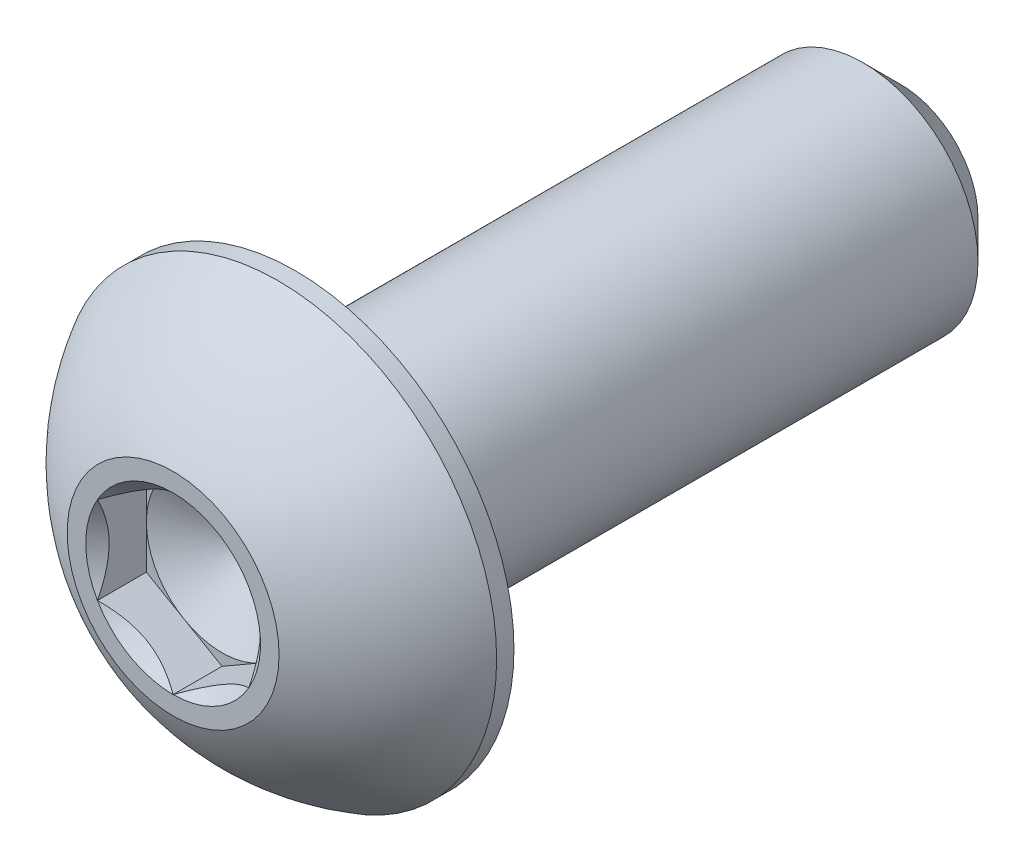
ISO-10303-21;
HEADER;
FILE_DESCRIPTION(('STEP AP214'),'2;1');
FILE_NAME('part.step','',(''),(''),'','','');
FILE_SCHEMA(('AUTOMOTIVE_DESIGN { 1 0 10303 214 1 1 1 1 }'));
ENDSEC;
DATA;
#1=APPLICATION_CONTEXT('core data for automotive mechanical design processes');
#2=APPLICATION_PROTOCOL_DEFINITION('international standard','automotive_design',2000,#1);
#3=PRODUCT_CONTEXT('',#1,'mechanical');
#4=PRODUCT('Part','Part','',(#3));
#5=PRODUCT_RELATED_PRODUCT_CATEGORY('part','',(#4));
#6=PRODUCT_DEFINITION_FORMATION('','',#4);
#7=PRODUCT_DEFINITION_CONTEXT('part definition',#1,'design');
#8=PRODUCT_DEFINITION('design','',#6,#7);
#9=PRODUCT_DEFINITION_SHAPE('','',#8);
#10=(LENGTH_UNIT() NAMED_UNIT(*) SI_UNIT(.MILLI.,.METRE.));
#11=(NAMED_UNIT(*) PLANE_ANGLE_UNIT() SI_UNIT($,.RADIAN.));
#12=(NAMED_UNIT(*) SI_UNIT($,.STERADIAN.) SOLID_ANGLE_UNIT());
#13=UNCERTAINTY_MEASURE_WITH_UNIT(LENGTH_MEASURE(1.E-05),#10,'distance_accuracy_value','');
#14=(GEOMETRIC_REPRESENTATION_CONTEXT(3) GLOBAL_UNCERTAINTY_ASSIGNED_CONTEXT((#13)) GLOBAL_UNIT_ASSIGNED_CONTEXT((#10,
#11,#12)) REPRESENTATION_CONTEXT('',''));
#15=CARTESIAN_POINT('',(0.,0.,0.));
#16=DIRECTION('',(0.,0.,1.));
#17=DIRECTION('',(1.,0.,0.));
#18=AXIS2_PLACEMENT_3D('',#15,#16,#17);
#19=CARTESIAN_POINT('',(0.,1.5875,7.6327));
#20=DIRECTION('',(0.,0.,-1.));
#21=DIRECTION('',(-1.,0.,0.));
#22=AXIS2_PLACEMENT_3D('',#19,#20,#21);
#23=PLANE('',#22);
#24=CARTESIAN_POINT('',(0.,0.,7.6327));
#25=DIRECTION('',(0.,0.,1.));
#26=DIRECTION('',(1.,0.,0.));
#27=AXIS2_PLACEMENT_3D('',#24,#25,#26);
#28=CIRCLE('',#27,2.2225);
#29=CARTESIAN_POINT('',(2.2225,0.,7.6327));
#30=VERTEX_POINT('',#29);
#31=EDGE_CURVE('E167',#30,#30,#28,.T.);
#32=ORIENTED_EDGE('',*,*,#31,.T.);
#33=EDGE_LOOP('',(#32));
#34=FACE_BOUND('',#33,.T.);
#35=CARTESIAN_POINT('',(0.,0.,7.6327));
#36=DIRECTION('',(0.,0.,1.));
#37=DIRECTION('',(1.,0.,0.));
#38=AXIS2_PLACEMENT_3D('',#35,#36,#37);
#39=CIRCLE('',#38,1.83308710467706);
#40=CARTESIAN_POINT('',(0.,1.83308710467706,7.6327));
#41=VERTEX_POINT('',#40);
#42=CARTESIAN_POINT('',(-1.5875,0.916543552338531,7.6327));
#43=VERTEX_POINT('',#42);
#44=EDGE_CURVE('E121',#41,#43,#39,.T.);
#45=ORIENTED_EDGE('',*,*,#44,.F.);
#46=CARTESIAN_POINT('',(0.,0.,7.6327));
#47=DIRECTION('',(0.,0.,1.));
#48=DIRECTION('',(1.,0.,0.));
#49=AXIS2_PLACEMENT_3D('',#46,#47,#48);
#50=CIRCLE('',#49,1.83308710467706);
#51=CARTESIAN_POINT('',(1.5875,0.916543552338531,7.6327));
#52=VERTEX_POINT('',#51);
#53=EDGE_CURVE('E106',#52,#41,#50,.T.);
#54=ORIENTED_EDGE('',*,*,#53,.F.);
#55=CARTESIAN_POINT('',(0.,0.,7.6327));
#56=DIRECTION('',(0.,0.,1.));
#57=DIRECTION('',(1.,0.,0.));
#58=AXIS2_PLACEMENT_3D('',#55,#56,#57);
#59=CIRCLE('',#58,1.83308710467706);
#60=CARTESIAN_POINT('',(1.5875,-0.916543552338531,7.6327));
#61=VERTEX_POINT('',#60);
#62=EDGE_CURVE('E117',#61,#52,#59,.T.);
#63=ORIENTED_EDGE('',*,*,#62,.F.);
#64=CARTESIAN_POINT('',(0.,0.,7.6327));
#65=DIRECTION('',(0.,0.,1.));
#66=DIRECTION('',(1.,0.,0.));
#67=AXIS2_PLACEMENT_3D('',#64,#65,#66);
#68=CIRCLE('',#67,1.83308710467706);
#69=CARTESIAN_POINT('',(0.,-1.83308710467706,7.6327));
#70=VERTEX_POINT('',#69);
#71=EDGE_CURVE('E138',#70,#61,#68,.T.);
#72=ORIENTED_EDGE('',*,*,#71,.F.);
#73=CARTESIAN_POINT('',(0.,0.,7.6327));
#74=DIRECTION('',(0.,0.,1.));
#75=DIRECTION('',(1.,0.,0.));
#76=AXIS2_PLACEMENT_3D('',#73,#74,#75);
#77=CIRCLE('',#76,1.83308710467706);
#78=CARTESIAN_POINT('',(-1.5875,-0.916543552338531,7.6327));
#79=VERTEX_POINT('',#78);
#80=EDGE_CURVE('E438',#79,#70,#77,.T.);
#81=ORIENTED_EDGE('',*,*,#80,.F.);
#82=CARTESIAN_POINT('',(0.,0.,7.6327));
#83=DIRECTION('',(0.,0.,1.));
#84=DIRECTION('',(1.,0.,0.));
#85=AXIS2_PLACEMENT_3D('',#82,#83,#84);
#86=CIRCLE('',#85,1.83308710467706);
#87=EDGE_CURVE('E447',#43,#79,#86,.T.);
#88=ORIENTED_EDGE('',*,*,#87,.F.);
#89=EDGE_LOOP('',(#45,#54,#63,#72,#81,#88));
#90=FACE_BOUND('',#89,.T.);
#91=ADVANCED_FACE('F33',(#34,#90),#23,.F.);
#92=CARTESIAN_POINT('',(0.,0.,-7.6327));
#93=DIRECTION('',(0.,0.,1.));
#94=DIRECTION('',(1.,0.,0.));
#95=AXIS2_PLACEMENT_3D('',#92,#93,#94);
#96=CONICAL_SURFACE('',#95,1.61925,0.785398163397447);
#97=CARTESIAN_POINT('',(0.,0.,-6.83895));
#98=DIRECTION('',(0.,0.,1.));
#99=DIRECTION('',(1.,0.,0.));
#100=AXIS2_PLACEMENT_3D('',#97,#98,#99);
#101=CIRCLE('',#100,2.413);
#102=CARTESIAN_POINT('',(2.413,0.,-6.83895));
#103=VERTEX_POINT('',#102);
#104=EDGE_CURVE('E11',#103,#103,#101,.T.);
#105=ORIENTED_EDGE('',*,*,#104,.F.);
#106=EDGE_LOOP('',(#105));
#107=FACE_BOUND('',#106,.T.);
#108=CARTESIAN_POINT('',(0.,0.,-7.6327));
#109=DIRECTION('',(0.,0.,1.));
#110=DIRECTION('',(1.,0.,0.));
#111=AXIS2_PLACEMENT_3D('',#108,#109,#110);
#112=CIRCLE('',#111,1.61925);
#113=CARTESIAN_POINT('',(1.61925,0.,-7.6327));
#114=VERTEX_POINT('',#113);
#115=EDGE_CURVE('E160',#114,#114,#112,.T.);
#116=ORIENTED_EDGE('',*,*,#115,.T.);
#117=EDGE_LOOP('',(#116));
#118=FACE_BOUND('',#117,.T.);
#119=ADVANCED_FACE('F35',(#107,#118),#96,.T.);
#120=CARTESIAN_POINT('',(0.,0.,7.6327));
#121=DIRECTION('',(0.,0.,1.));
#122=DIRECTION('',(1.,0.,0.));
#123=AXIS2_PLACEMENT_3D('',#120,#121,#122);
#124=CYLINDRICAL_SURFACE('',#123,2.413);
#125=CARTESIAN_POINT('',(0.,0.,5.0673));
#126=DIRECTION('',(0.,0.,1.));
#127=DIRECTION('',(1.,0.,0.));
#128=AXIS2_PLACEMENT_3D('',#125,#126,#127);
#129=CIRCLE('',#128,2.413);
#130=CARTESIAN_POINT('',(2.413,0.,5.0673));
#131=VERTEX_POINT('',#130);
#132=EDGE_CURVE('E41',#131,#131,#129,.T.);
#133=ORIENTED_EDGE('',*,*,#132,.F.);
#134=EDGE_LOOP('',(#133));
#135=FACE_BOUND('',#134,.T.);
#136=ORIENTED_EDGE('',*,*,#104,.T.);
#137=EDGE_LOOP('',(#136));
#138=FACE_BOUND('',#137,.T.);
#139=ADVANCED_FACE('F181',(#135,#138),#124,.T.);
#140=CARTESIAN_POINT('',(0.,4.5847,5.0673));
#141=DIRECTION('',(0.,0.,1.));
#142=DIRECTION('',(1.,0.,0.));
#143=AXIS2_PLACEMENT_3D('',#140,#141,#142);
#144=PLANE('',#143);
#145=CARTESIAN_POINT('',(0.,0.,5.0673));
#146=DIRECTION('',(0.,0.,1.));
#147=DIRECTION('',(1.,0.,0.));
#148=AXIS2_PLACEMENT_3D('',#145,#146,#147);
#149=CIRCLE('',#148,4.5847);
#150=CARTESIAN_POINT('',(4.5847,0.,5.0673));
#151=VERTEX_POINT('',#150);
#152=EDGE_CURVE('E174',#151,#151,#149,.T.);
#153=ORIENTED_EDGE('',*,*,#152,.F.);
#154=EDGE_LOOP('',(#153));
#155=FACE_BOUND('',#154,.T.);
#156=ORIENTED_EDGE('',*,*,#132,.T.);
#157=EDGE_LOOP('',(#156));
#158=FACE_BOUND('',#157,.T.);
#159=ADVANCED_FACE('F179',(#155,#158),#144,.F.);
#160=CARTESIAN_POINT('',(0.,0.,7.6327));
#161=DIRECTION('',(0.,0.,1.));
#162=DIRECTION('',(1.,0.,0.));
#163=AXIS2_PLACEMENT_3D('',#160,#161,#162);
#164=CYLINDRICAL_SURFACE('',#163,4.5847);
#165=CARTESIAN_POINT('',(0.,0.,5.43015714285714));
#166=DIRECTION('',(0.,0.,1.));
#167=DIRECTION('',(1.,0.,0.));
#168=AXIS2_PLACEMENT_3D('',#165,#166,#167);
#169=CIRCLE('',#168,4.5847);
#170=CARTESIAN_POINT('',(4.5847,0.,5.43015714285714));
#171=VERTEX_POINT('',#170);
#172=EDGE_CURVE('E171',#171,#171,#169,.T.);
#173=ORIENTED_EDGE('',*,*,#172,.F.);
#174=EDGE_LOOP('',(#173));
#175=FACE_BOUND('',#174,.T.);
#176=ORIENTED_EDGE('',*,*,#152,.T.);
#177=EDGE_LOOP('',(#176));
#178=FACE_BOUND('',#177,.T.);
#179=ADVANCED_FACE('F200',(#175,#178),#164,.T.);
#180=CARTESIAN_POINT('',(0.,0.,2.88110962579431));
#181=DIRECTION('',(0.,0.,1.));
#182=DIRECTION('',(0.,1.,0.));
#183=AXIS2_PLACEMENT_3D('',#180,#181,#182);
#184=SPHERICAL_SURFACE('',#183,5.24567606074224);
#185=ORIENTED_EDGE('',*,*,#31,.F.);
#186=EDGE_LOOP('',(#185));
#187=FACE_BOUND('',#186,.T.);
#188=ORIENTED_EDGE('',*,*,#172,.T.);
#189=EDGE_LOOP('',(#188));
#190=FACE_BOUND('',#189,.T.);
#191=ADVANCED_FACE('F192',(#187,#190),#184,.T.);
#192=CARTESIAN_POINT('',(0.,1.61925,-7.6327));
#193=DIRECTION('',(0.,0.,1.));
#194=DIRECTION('',(1.,0.,0.));
#195=AXIS2_PLACEMENT_3D('',#192,#193,#194);
#196=PLANE('',#195);
#197=ORIENTED_EDGE('',*,*,#115,.F.);
#198=EDGE_LOOP('',(#197));
#199=FACE_BOUND('',#198,.T.);
#200=ADVANCED_FACE('F190',(#199),#196,.F.);
#201=CARTESIAN_POINT('',(1.5875,0.916543552338532,7.6327));
#202=DIRECTION('',(-0.499999999999999,-0.866025403784439,0.));
#203=DIRECTION('',(0.866025403784439,-0.499999999999999,0.));
#204=AXIS2_PLACEMENT_3D('',#201,#202,#203);
#205=PLANE('',#204);
#206=CARTESIAN_POINT('',(1.5877,0.916428082284694,7.63281548096371));
#207=CARTESIAN_POINT('',(1.53312479190086,0.94793709337181,7.6013308083706));
#208=CARTESIAN_POINT('',(1.47763696320971,0.979973006203396,7.57169504601353));
#209=CARTESIAN_POINT('',(1.36449087915364,1.04529792829092,7.51743226002082));
#210=CARTESIAN_POINT('',(1.30682185887062,1.07859315267522,7.49283543513318));
#211=CARTESIAN_POINT('',(1.1905349781269,1.14573141457583,7.45070036427258));
#212=CARTESIAN_POINT('',(1.13194674474407,1.17955734689075,7.43305619272982));
#213=CARTESIAN_POINT('',(1.01348022674557,1.24795402294715,7.40587147008497));
#214=CARTESIAN_POINT('',(0.953605562983894,1.28252267618759,7.39631062069508));
#215=CARTESIAN_POINT('',(0.850418771876556,1.34209759781022,7.38768441310401));
#216=CARTESIAN_POINT('',(0.807240015952286,1.36702686416637,7.38640719280958));
#217=CARTESIAN_POINT('',(0.720953038535397,1.41684467380557,7.3885570558147));
#218=CARTESIAN_POINT('',(0.67784484707861,1.44173319974743,7.39198578854934));
#219=CARTESIAN_POINT('',(0.592046335002029,1.49126899379091,7.40335099443334));
#220=CARTESIAN_POINT('',(0.549356408925404,1.51591603410293,7.41129137180164));
#221=CARTESIAN_POINT('',(0.464693063478357,1.56479643938728,7.4312484144511));
#222=CARTESIAN_POINT('',(0.422719959755073,1.58902962212064,7.44326682920869));
#223=CARTESIAN_POINT('',(0.315211458113564,1.65109968448354,7.47894689724725));
#224=CARTESIAN_POINT('',(0.250342771708898,1.68855163804125,7.50529857230314));
#225=CARTESIAN_POINT('',(0.154961599380923,1.74361998356043,7.5497835368517));
#226=CARTESIAN_POINT('',(0.123530699536156,1.76176662204668,7.56541285780113));
#227=CARTESIAN_POINT('',(0.0612469855696361,1.79772614107138,7.5980984878611));
#228=CARTESIAN_POINT('',(0.0303939039605758,1.8155391760437,7.61515411565697));
#229=CARTESIAN_POINT('',(-0.00020000000000091,1.8332025747309,7.63281548096371));
#230=B_SPLINE_CURVE_WITH_KNOTS('',3,(#206,#207,#208,#209,#210,#211,#212,#213,#214,#215,#216,
#217,#218,#219,#220,#221,#222,#223,#224,#225,#226,#227,#228,#229),.UNSPECIFIED.,.F.,.F.,(4,2,2,
2,2,2,2,2,2,2,2,4),(0.,0.211482650810817,0.424197870807277,0.633533884524816,0.84234265326335,
0.991755553727143,1.14122083674205,1.29081565918877,1.44047473906438,1.6781878086972,
1.79671410024894,1.91518409436631),.UNSPECIFIED.);
#231=EDGE_CURVE('E103',#52,#41,#230,.T.);
#232=ORIENTED_EDGE('',*,*,#231,.T.);
#233=DIRECTION('',(0.,0.,-1.));
#234=VECTOR('',#233,1.);
#235=CARTESIAN_POINT('',(0.,1.83308710467706,7.6327));
#236=LINE('',#235,#234);
#237=CARTESIAN_POINT('',(0.,1.83308710467706,6.60654));
#238=VERTEX_POINT('',#237);
#239=EDGE_CURVE('E158',#41,#238,#236,.T.);
#240=ORIENTED_EDGE('',*,*,#239,.T.);
#241=DIRECTION('',(-0.866025403784439,0.499999999999999,0.));
#242=VECTOR('',#241,1.);
#243=CARTESIAN_POINT('',(1.5875,0.916543552338532,6.60654));
#244=LINE('',#243,#242);
#245=CARTESIAN_POINT('',(0.793749999999999,1.3748153285078,6.60654));
#246=VERTEX_POINT('',#245);
#247=EDGE_CURVE('E474',#246,#238,#244,.T.);
#248=ORIENTED_EDGE('',*,*,#247,.F.);
#249=CARTESIAN_POINT('',(1.5875,0.916543552338532,6.60654));
#250=VERTEX_POINT('',#249);
#251=EDGE_CURVE('E48',#250,#246,#244,.T.);
#252=ORIENTED_EDGE('',*,*,#251,.F.);
#253=DIRECTION('',(0.,0.,-1.));
#254=VECTOR('',#253,1.);
#255=CARTESIAN_POINT('',(1.5875,0.916543552338532,7.6327));
#256=LINE('',#255,#254);
#257=EDGE_CURVE('E134',#52,#250,#256,.T.);
#258=ORIENTED_EDGE('',*,*,#257,.F.);
#259=EDGE_LOOP('',(#232,#240,#248,#252,#258));
#260=FACE_BOUND('',#259,.T.);
#261=ADVANCED_FACE('F140',(#260),#205,.T.);
#262=CARTESIAN_POINT('',(0.,1.83308710467706,7.6327));
#263=DIRECTION('',(0.500000000000001,-0.866025403784438,0.));
#264=DIRECTION('',(0.866025403784438,0.500000000000001,0.));
#265=AXIS2_PLACEMENT_3D('',#262,#263,#264);
#266=PLANE('',#265);
#267=CARTESIAN_POINT('',(0.000199999999998876,1.8332025747309,7.63281548096371));
#268=CARTESIAN_POINT('',(-0.0543752080991377,1.80169356364378,7.6013308083706));
#269=CARTESIAN_POINT('',(-0.109863036790291,1.7696576508122,7.57169504601353));
#270=CARTESIAN_POINT('',(-0.22300912084636,1.70433272872467,7.51743226002082));
#271=CARTESIAN_POINT('',(-0.280678141129382,1.67103750434037,7.49283543513318));
#272=CARTESIAN_POINT('',(-0.396965021873104,1.60389924243976,7.45070036427258));
#273=CARTESIAN_POINT('',(-0.455553255255932,1.57007331012484,7.43305619272982));
#274=CARTESIAN_POINT('',(-0.574019773254432,1.50167663406845,7.40587147008497));
#275=CARTESIAN_POINT('',(-0.633894437016106,1.46710798082801,7.39631062069508));
#276=CARTESIAN_POINT('',(-0.737081228123443,1.40753305920537,7.38768441310401));
#277=CARTESIAN_POINT('',(-0.780259984047713,1.38260379284922,7.38640719280957));
#278=CARTESIAN_POINT('',(-0.866546961464602,1.33278598321002,7.3885570558147));
#279=CARTESIAN_POINT('',(-0.909655152921389,1.30789745726817,7.39198578854934));
#280=CARTESIAN_POINT('',(-0.99545366499797,1.25836166322468,7.40335099443334));
#281=CARTESIAN_POINT('',(-1.03814359107459,1.23371462291266,7.41129137180164));
#282=CARTESIAN_POINT('',(-1.12280693652164,1.18483421762831,7.4312484144511));
#283=CARTESIAN_POINT('',(-1.16478004024493,1.16060103489495,7.44326682920869));
#284=CARTESIAN_POINT('',(-1.27228854188643,1.09853097253205,7.47894689724724));
#285=CARTESIAN_POINT('',(-1.3371572282911,1.06107901897434,7.50529857230314));
#286=CARTESIAN_POINT('',(-1.43253840061908,1.00601067345516,7.5497835368517));
#287=CARTESIAN_POINT('',(-1.46396930046384,0.987864034968913,7.56541285780113));
#288=CARTESIAN_POINT('',(-1.52625301443036,0.951904515944213,7.5980984878611));
#289=CARTESIAN_POINT('',(-1.55710609603942,0.934091480971893,7.61515411565697));
#290=CARTESIAN_POINT('',(-1.5877,0.916428082284692,7.63281548096371));
#291=B_SPLINE_CURVE_WITH_KNOTS('',3,(#267,#268,#269,#270,#271,#272,#273,#274,#275,#276,#277,
#278,#279,#280,#281,#282,#283,#284,#285,#286,#287,#288,#289,#290),.UNSPECIFIED.,.F.,.F.,(4,2,2,
2,2,2,2,2,2,2,2,4),(0.,0.211482650810816,0.424197870807276,0.633533884524816,0.842342653263348,
0.991755553727141,1.14122083674204,1.29081565918877,1.44047473906438,1.6781878086972,
1.79671410024894,1.91518409436631),.UNSPECIFIED.);
#292=EDGE_CURVE('E462',#41,#43,#291,.T.);
#293=ORIENTED_EDGE('',*,*,#292,.T.);
#294=DIRECTION('',(0.,0.,-1.));
#295=VECTOR('',#294,1.);
#296=CARTESIAN_POINT('',(-1.5875,0.91654355233853,7.6327));
#297=LINE('',#296,#295);
#298=CARTESIAN_POINT('',(-1.5875,0.91654355233853,6.60654));
#299=VERTEX_POINT('',#298);
#300=EDGE_CURVE('E155',#43,#299,#297,.T.);
#301=ORIENTED_EDGE('',*,*,#300,.T.);
#302=DIRECTION('',(-0.866025403784438,-0.500000000000001,0.));
#303=VECTOR('',#302,1.);
#304=CARTESIAN_POINT('',(0.,1.83308710467706,6.60654));
#305=LINE('',#304,#303);
#306=CARTESIAN_POINT('',(-0.793750000000001,1.3748153285078,6.60654));
#307=VERTEX_POINT('',#306);
#308=EDGE_CURVE('E476',#307,#299,#305,.T.);
#309=ORIENTED_EDGE('',*,*,#308,.F.);
#310=EDGE_CURVE('E477',#238,#307,#305,.T.);
#311=ORIENTED_EDGE('',*,*,#310,.F.);
#312=ORIENTED_EDGE('',*,*,#239,.F.);
#313=EDGE_LOOP('',(#293,#301,#309,#311,#312));
#314=FACE_BOUND('',#313,.T.);
#315=ADVANCED_FACE('F198',(#314),#266,.T.);
#316=CARTESIAN_POINT('',(-1.5875,0.91654355233853,7.6327));
#317=DIRECTION('',(1.,0.,0.));
#318=DIRECTION('',(0.,0.,-1.));
#319=AXIS2_PLACEMENT_3D('',#316,#317,#318);
#320=PLANE('',#319);
#321=CARTESIAN_POINT('',(-1.5875,-1.8064504268921,8.20448698658398));
#322=CARTESIAN_POINT('',(-1.5875,-1.76236619947005,8.17137765189215));
#323=CARTESIAN_POINT('',(-1.5875,-1.71803401722459,8.13859936728741));
#324=CARTESIAN_POINT('',(-1.5875,-1.62877387436181,8.07384092729782));
#325=CARTESIAN_POINT('',(-1.5875,-1.58384576476286,8.04186097748321));
#326=CARTESIAN_POINT('',(-1.5875,-1.44736053267712,7.94686696154791));
#327=CARTESIAN_POINT('',(-1.5875,-1.3547728804759,7.88530882424476));
#328=CARTESIAN_POINT('',(-1.5875,-1.16075761948671,7.76465751972008));
#329=CARTESIAN_POINT('',(-1.5875,-1.05912459725148,7.70589084409804));
#330=CARTESIAN_POINT('',(-1.5875,-0.850810108093356,7.59853067812025));
#331=CARTESIAN_POINT('',(-1.5875,-0.744147188151383,7.5499029254242));
#332=CARTESIAN_POINT('',(-1.5875,-0.583837187923045,7.49041807950615));
#333=CARTESIAN_POINT('',(-1.5875,-0.532518160842358,7.47331011476258));
#334=CARTESIAN_POINT('',(-1.5875,-0.428659985513866,7.44321705307571));
#335=CARTESIAN_POINT('',(-1.5875,-0.37612075167657,7.43023224628787));
#336=CARTESIAN_POINT('',(-1.5875,-0.271003698108568,7.40927039746268));
#337=CARTESIAN_POINT('',(-1.5875,-0.218442994151922,7.40120885122062));
#338=CARTESIAN_POINT('',(-1.5875,-0.112783135871372,7.39024746810392));
#339=CARTESIAN_POINT('',(-1.5875,-0.0596840710482699,7.38734678695656));
#340=CARTESIAN_POINT('',(-1.5875,0.0447055832560295,7.38691381931861));
#341=CARTESIAN_POINT('',(-1.5875,0.0959954901561851,7.38920012793679));
#342=CARTESIAN_POINT('',(-1.5875,0.19812518570528,7.39861970580147));
#343=CARTESIAN_POINT('',(-1.5875,0.248964929488492,7.40575345278263));
#344=CARTESIAN_POINT('',(-1.5875,0.350686556652123,7.42460310969938));
#345=CARTESIAN_POINT('',(-1.5875,0.401553911407877,7.43639626149498));
#346=CARTESIAN_POINT('',(-1.5875,0.50217981053946,7.46394443755636));
#347=CARTESIAN_POINT('',(-1.5875,0.551938454553038,7.47969910423224));
#348=CARTESIAN_POINT('',(-1.5875,0.709597941546692,7.53551737605638));
#349=CARTESIAN_POINT('',(-1.5875,0.815228306930166,7.58197915633839));
#350=CARTESIAN_POINT('',(-1.5875,1.02151735170486,7.68525145508529));
#351=CARTESIAN_POINT('',(-1.5875,1.12215634479547,7.74209935808162));
#352=CARTESIAN_POINT('',(-1.5875,1.31447644029508,7.85934912470739));
#353=CARTESIAN_POINT('',(-1.5875,1.40635401847359,7.91943268451341));
#354=CARTESIAN_POINT('',(-1.5875,1.54171769329396,8.01230190804474));
#355=CARTESIAN_POINT('',(-1.5875,1.58625419266992,8.04358312786968));
#356=CARTESIAN_POINT('',(-1.5875,1.67471932537719,8.10696920360769));
#357=CARTESIAN_POINT('',(-1.5875,1.71864812234279,8.13907383088692));
#358=CARTESIAN_POINT('',(-1.5875,1.76232404534813,8.17151978447609));
#359=B_SPLINE_CURVE_WITH_KNOTS('',3,(#321,#322,#323,#324,#325,#326,#327,#328,#329,#330,#331,
#332,#333,#334,#335,#336,#337,#338,#339,#340,#341,#342,#343,#344,#345,#346,#347,#348,#349,#350,
#351,#352,#353,#354,#355,#356,#357,#358),.UNSPECIFIED.,.F.,.F.,(4,2,2,2,2,2,2,2,2,2,2,2,2,2,2,2,
2,2,4),(0.,0.165394720611771,0.330831599805601,0.664230904656282,1.01613642769877,
1.36683276443451,1.5289815746679,1.69114179313303,1.85043410106595,2.00970034776346,
2.16348276168557,2.31728033368487,2.47374234648083,2.63019024115108,2.97536284656899,
3.32180328575216,3.65097853196649,3.8142455159316,3.97746764647571),.UNSPECIFIED.);
#360=EDGE_CURVE('E455',#43,#79,#359,.F.);
#361=ORIENTED_EDGE('',*,*,#360,.T.);
#362=DIRECTION('',(0.,0.,-1.));
#363=VECTOR('',#362,1.);
#364=CARTESIAN_POINT('',(-1.5875,-0.916543552338532,7.6327));
#365=LINE('',#364,#363);
#366=CARTESIAN_POINT('',(-1.5875,-0.916543552338532,6.60654));
#367=VERTEX_POINT('',#366);
#368=EDGE_CURVE('E152',#79,#367,#365,.T.);
#369=ORIENTED_EDGE('',*,*,#368,.T.);
#370=DIRECTION('',(0.,-1.,0.));
#371=VECTOR('',#370,1.);
#372=CARTESIAN_POINT('',(-1.5875,0.91654355233853,6.60654));
#373=LINE('',#372,#371);
#374=CARTESIAN_POINT('',(-1.5875,0.,6.60654));
#375=VERTEX_POINT('',#374);
#376=EDGE_CURVE('E480',#375,#367,#373,.T.);
#377=ORIENTED_EDGE('',*,*,#376,.F.);
#378=EDGE_CURVE('E481',#299,#375,#373,.T.);
#379=ORIENTED_EDGE('',*,*,#378,.F.);
#380=ORIENTED_EDGE('',*,*,#300,.F.);
#381=EDGE_LOOP('',(#361,#369,#377,#379,#380));
#382=FACE_BOUND('',#381,.T.);
#383=ADVANCED_FACE('F319',(#382),#320,.T.);
#384=CARTESIAN_POINT('',(-1.5875,-0.916543552338532,7.6327));
#385=DIRECTION('',(0.5,0.866025403784439,0.));
#386=DIRECTION('',(-0.866025403784439,0.5,0.));
#387=AXIS2_PLACEMENT_3D('',#384,#385,#386);
#388=PLANE('',#387);
#389=CARTESIAN_POINT('',(-1.5877,-0.916428082284694,7.63281548096371));
#390=CARTESIAN_POINT('',(-1.53312479190086,-0.94793709337181,7.6013308083706));
#391=CARTESIAN_POINT('',(-1.47763696320971,-0.979973006203395,7.57169504601353));
#392=CARTESIAN_POINT('',(-1.36449087915364,-1.04529792829092,7.51743226002082));
#393=CARTESIAN_POINT('',(-1.30682185887062,-1.07859315267522,7.49283543513318));
#394=CARTESIAN_POINT('',(-1.1905349781269,-1.14573141457583,7.45070036427258));
#395=CARTESIAN_POINT('',(-1.13194674474407,-1.17955734689075,7.43305619272982));
#396=CARTESIAN_POINT('',(-1.01348022674557,-1.24795402294714,7.40587147008497));
#397=CARTESIAN_POINT('',(-0.953605562983895,-1.28252267618759,7.39631062069508));
#398=CARTESIAN_POINT('',(-0.850418771876557,-1.34209759781022,7.38768441310401));
#399=CARTESIAN_POINT('',(-0.807240015952287,-1.36702686416637,7.38640719280957));
#400=CARTESIAN_POINT('',(-0.720953038535398,-1.41684467380557,7.3885570558147));
#401=CARTESIAN_POINT('',(-0.677844847078611,-1.44173319974742,7.39198578854934));
#402=CARTESIAN_POINT('',(-0.59204633500203,-1.49126899379091,7.40335099443334));
#403=CARTESIAN_POINT('',(-0.549356408925406,-1.51591603410293,7.41129137180164));
#404=CARTESIAN_POINT('',(-0.464693063478358,-1.56479643938728,7.4312484144511));
#405=CARTESIAN_POINT('',(-0.422719959755074,-1.58902962212064,7.44326682920869));
#406=CARTESIAN_POINT('',(-0.315211458113566,-1.65109968448354,7.47894689724725));
#407=CARTESIAN_POINT('',(-0.2503427717089,-1.68855163804125,7.50529857230314));
#408=CARTESIAN_POINT('',(-0.154961599380923,-1.74361998356043,7.5497835368517));
#409=CARTESIAN_POINT('',(-0.123530699536156,-1.76176662204668,7.56541285780113));
#410=CARTESIAN_POINT('',(-0.061246985569636,-1.79772614107138,7.5980984878611));
#411=CARTESIAN_POINT('',(-0.0303939039605754,-1.8155391760437,7.61515411565697));
#412=CARTESIAN_POINT('',(0.000200000000001136,-1.8332025747309,7.63281548096371));
#413=B_SPLINE_CURVE_WITH_KNOTS('',3,(#389,#390,#391,#392,#393,#394,#395,#396,#397,#398,#399,
#400,#401,#402,#403,#404,#405,#406,#407,#408,#409,#410,#411,#412),.UNSPECIFIED.,.F.,.F.,(4,2,2,
2,2,2,2,2,2,2,2,4),(0.,0.211482650810816,0.424197870807276,0.633533884524816,0.842342653263348,
0.991755553727141,1.14122083674205,1.29081565918877,1.44047473906438,1.6781878086972,
1.79671410024894,1.91518409436631),.UNSPECIFIED.);
#414=EDGE_CURVE('E440',#79,#70,#413,.T.);
#415=ORIENTED_EDGE('',*,*,#414,.T.);
#416=DIRECTION('',(0.,0.,-1.));
#417=VECTOR('',#416,1.);
#418=CARTESIAN_POINT('',(0.,-1.83308710467706,7.6327));
#419=LINE('',#418,#417);
#420=CARTESIAN_POINT('',(0.,-1.83308710467706,6.60654));
#421=VERTEX_POINT('',#420);
#422=EDGE_CURVE('E143',#70,#421,#419,.T.);
#423=ORIENTED_EDGE('',*,*,#422,.T.);
#424=DIRECTION('',(0.866025403784439,-0.499999999999999,0.));
#425=VECTOR('',#424,1.);
#426=CARTESIAN_POINT('',(-1.5875,-0.916543552338532,6.60654));
#427=LINE('',#426,#425);
#428=CARTESIAN_POINT('',(-0.793749999999999,-1.3748153285078,6.60654));
#429=VERTEX_POINT('',#428);
#430=EDGE_CURVE('E484',#429,#421,#427,.T.);
#431=ORIENTED_EDGE('',*,*,#430,.F.);
#432=EDGE_CURVE('E485',#367,#429,#427,.T.);
#433=ORIENTED_EDGE('',*,*,#432,.F.);
#434=ORIENTED_EDGE('',*,*,#368,.F.);
#435=EDGE_LOOP('',(#415,#423,#431,#433,#434));
#436=FACE_BOUND('',#435,.T.);
#437=ADVANCED_FACE('F329',(#436),#388,.T.);
#438=CARTESIAN_POINT('',(0.,-1.83308710467706,7.6327));
#439=DIRECTION('',(-0.5,0.866025403784438,0.));
#440=DIRECTION('',(-0.866025403784438,-0.5,0.));
#441=AXIS2_PLACEMENT_3D('',#438,#439,#440);
#442=PLANE('',#441);
#443=CARTESIAN_POINT('',(-0.00019999999999881,-1.8332025747309,7.63281548096371));
#444=CARTESIAN_POINT('',(0.0543752080991374,-1.80169356364378,7.6013308083706));
#445=CARTESIAN_POINT('',(0.109863036790291,-1.7696576508122,7.57169504601353));
#446=CARTESIAN_POINT('',(0.22300912084636,-1.70433272872467,7.51743226002082));
#447=CARTESIAN_POINT('',(0.280678141129382,-1.67103750434037,7.49283543513318));
#448=CARTESIAN_POINT('',(0.396965021873105,-1.60389924243976,7.45070036427258));
#449=CARTESIAN_POINT('',(0.455553255255933,-1.57007331012484,7.43305619272982));
#450=CARTESIAN_POINT('',(0.574019773254432,-1.50167663406845,7.40587147008497));
#451=CARTESIAN_POINT('',(0.633894437016106,-1.46710798082801,7.39631062069508));
#452=CARTESIAN_POINT('',(0.737081228123444,-1.40753305920537,7.38768441310401));
#453=CARTESIAN_POINT('',(0.780259984047714,-1.38260379284922,7.38640719280958));
#454=CARTESIAN_POINT('',(0.866546961464603,-1.33278598321002,7.3885570558147));
#455=CARTESIAN_POINT('',(0.909655152921389,-1.30789745726817,7.39198578854934));
#456=CARTESIAN_POINT('',(0.995453664997971,-1.25836166322468,7.40335099443334));
#457=CARTESIAN_POINT('',(1.0381435910746,-1.23371462291266,7.41129137180164));
#458=CARTESIAN_POINT('',(1.12280693652164,-1.18483421762831,7.4312484144511));
#459=CARTESIAN_POINT('',(1.16478004024493,-1.16060103489495,7.44326682920869));
#460=CARTESIAN_POINT('',(1.27228854188643,-1.09853097253205,7.47894689724725));
#461=CARTESIAN_POINT('',(1.3371572282911,-1.06107901897434,7.50529857230314));
#462=CARTESIAN_POINT('',(1.43253840061908,-1.00601067345516,7.5497835368517));
#463=CARTESIAN_POINT('',(1.46396930046384,-0.987864034968914,7.56541285780113));
#464=CARTESIAN_POINT('',(1.52625301443036,-0.951904515944214,7.5980984878611));
#465=CARTESIAN_POINT('',(1.55710609603942,-0.934091480971894,7.61515411565697));
#466=CARTESIAN_POINT('',(1.5877,-0.916428082284693,7.63281548096371));
#467=B_SPLINE_CURVE_WITH_KNOTS('',3,(#443,#444,#445,#446,#447,#448,#449,#450,#451,#452,#453,
#454,#455,#456,#457,#458,#459,#460,#461,#462,#463,#464,#465,#466),.UNSPECIFIED.,.F.,.F.,(4,2,2,
2,2,2,2,2,2,2,2,4),(0.,0.211482650810817,0.424197870807276,0.633533884524816,0.842342653263349,
0.991755553727142,1.14122083674205,1.29081565918877,1.44047473906438,1.6781878086972,
1.79671410024894,1.91518409436631),.UNSPECIFIED.);
#468=EDGE_CURVE('E431',#70,#61,#467,.T.);
#469=ORIENTED_EDGE('',*,*,#468,.T.);
#470=DIRECTION('',(0.,0.,-1.));
#471=VECTOR('',#470,1.);
#472=CARTESIAN_POINT('',(1.5875,-0.916543552338531,7.6327));
#473=LINE('',#472,#471);
#474=CARTESIAN_POINT('',(1.5875,-0.916543552338531,6.60654));
#475=VERTEX_POINT('',#474);
#476=EDGE_CURVE('E137',#61,#475,#473,.T.);
#477=ORIENTED_EDGE('',*,*,#476,.T.);
#478=DIRECTION('',(0.866025403784438,0.5,0.));
#479=VECTOR('',#478,1.);
#480=CARTESIAN_POINT('',(0.,-1.83308710467706,6.60654));
#481=LINE('',#480,#479);
#482=CARTESIAN_POINT('',(0.793750000000001,-1.3748153285078,6.60654));
#483=VERTEX_POINT('',#482);
#484=EDGE_CURVE('E487',#483,#475,#481,.T.);
#485=ORIENTED_EDGE('',*,*,#484,.F.);
#486=EDGE_CURVE('E488',#421,#483,#481,.T.);
#487=ORIENTED_EDGE('',*,*,#486,.F.);
#488=ORIENTED_EDGE('',*,*,#422,.F.);
#489=EDGE_LOOP('',(#469,#477,#485,#487,#488));
#490=FACE_BOUND('',#489,.T.);
#491=ADVANCED_FACE('F339',(#490),#442,.T.);
#492=CARTESIAN_POINT('',(1.5875,-0.916543552338531,7.6327));
#493=DIRECTION('',(-1.,0.,0.));
#494=DIRECTION('',(0.,-1.,0.));
#495=AXIS2_PLACEMENT_3D('',#492,#493,#494);
#496=PLANE('',#495);
#497=CARTESIAN_POINT('',(1.5875,-1.8064504268921,8.20448698658398));
#498=CARTESIAN_POINT('',(1.5875,-1.76236619947005,8.17137765189215));
#499=CARTESIAN_POINT('',(1.5875,-1.71803401722459,8.13859936728741));
#500=CARTESIAN_POINT('',(1.5875,-1.62877387436181,8.07384092729782));
#501=CARTESIAN_POINT('',(1.5875,-1.58384576476286,8.04186097748321));
#502=CARTESIAN_POINT('',(1.5875,-1.44736053267712,7.94686696154791));
#503=CARTESIAN_POINT('',(1.5875,-1.3547728804759,7.88530882424476));
#504=CARTESIAN_POINT('',(1.5875,-1.16075761948671,7.76465751972008));
#505=CARTESIAN_POINT('',(1.5875,-1.05912459725148,7.70589084409804));
#506=CARTESIAN_POINT('',(1.5875,-0.850810108093355,7.59853067812025));
#507=CARTESIAN_POINT('',(1.5875,-0.744147188151383,7.5499029254242));
#508=CARTESIAN_POINT('',(1.5875,-0.583837187923044,7.49041807950615));
#509=CARTESIAN_POINT('',(1.5875,-0.532518160842357,7.47331011476258));
#510=CARTESIAN_POINT('',(1.5875,-0.428659985513866,7.44321705307571));
#511=CARTESIAN_POINT('',(1.5875,-0.37612075167657,7.43023224628787));
#512=CARTESIAN_POINT('',(1.5875,-0.271003698108568,7.40927039746268));
#513=CARTESIAN_POINT('',(1.5875,-0.218442994151922,7.40120885122062));
#514=CARTESIAN_POINT('',(1.5875,-0.112783135871372,7.39024746810392));
#515=CARTESIAN_POINT('',(1.5875,-0.0596840710482697,7.38734678695656));
#516=CARTESIAN_POINT('',(1.5875,0.0447055832560298,7.38691381931861));
#517=CARTESIAN_POINT('',(1.5875,0.0959954901561854,7.38920012793679));
#518=CARTESIAN_POINT('',(1.5875,0.19812518570528,7.39861970580147));
#519=CARTESIAN_POINT('',(1.5875,0.248964929488492,7.40575345278263));
#520=CARTESIAN_POINT('',(1.5875,0.350686556652123,7.42460310969938));
#521=CARTESIAN_POINT('',(1.5875,0.401553911407877,7.43639626149498));
#522=CARTESIAN_POINT('',(1.5875,0.50217981053946,7.46394443755636));
#523=CARTESIAN_POINT('',(1.5875,0.551938454553039,7.47969910423224));
#524=CARTESIAN_POINT('',(1.5875,0.709597941546693,7.53551737605638));
#525=CARTESIAN_POINT('',(1.5875,0.815228306930167,7.58197915633839));
#526=CARTESIAN_POINT('',(1.5875,1.02151735170486,7.68525145508529));
#527=CARTESIAN_POINT('',(1.5875,1.12215634479547,7.74209935808162));
#528=CARTESIAN_POINT('',(1.5875,1.31447644029508,7.85934912470739));
#529=CARTESIAN_POINT('',(1.5875,1.40635401847359,7.91943268451341));
#530=CARTESIAN_POINT('',(1.5875,1.54171769329396,8.01230190804474));
#531=CARTESIAN_POINT('',(1.5875,1.58625419266993,8.04358312786969));
#532=CARTESIAN_POINT('',(1.5875,1.67471932537719,8.10696920360769));
#533=CARTESIAN_POINT('',(1.5875,1.71864812234279,8.13907383088692));
#534=CARTESIAN_POINT('',(1.5875,1.76232404534813,8.17151978447609));
#535=B_SPLINE_CURVE_WITH_KNOTS('',3,(#497,#498,#499,#500,#501,#502,#503,#504,#505,#506,#507,
#508,#509,#510,#511,#512,#513,#514,#515,#516,#517,#518,#519,#520,#521,#522,#523,#524,#525,#526,
#527,#528,#529,#530,#531,#532,#533,#534),.UNSPECIFIED.,.F.,.F.,(4,2,2,2,2,2,2,2,2,2,2,2,2,2,2,2,
2,2,4),(0.,0.165394720611771,0.3308315998056,0.664230904656282,1.01613642769877,
1.36683276443451,1.5289815746679,1.69114179313303,1.85043410106595,2.00970034776346,
2.16348276168556,2.31728033368487,2.47374234648083,2.63019024115108,2.97536284656899,
3.32180328575216,3.65097853196649,3.8142455159316,3.97746764647571),.UNSPECIFIED.);
#536=EDGE_CURVE('E127',#61,#52,#535,.T.);
#537=ORIENTED_EDGE('',*,*,#536,.T.);
#538=ORIENTED_EDGE('',*,*,#257,.T.);
#539=DIRECTION('',(0.,1.,0.));
#540=VECTOR('',#539,1.);
#541=CARTESIAN_POINT('',(1.5875,-0.916543552338531,6.60654));
#542=LINE('',#541,#540);
#543=CARTESIAN_POINT('',(1.5875,0.,6.60654));
#544=VERTEX_POINT('',#543);
#545=EDGE_CURVE('E146',#544,#250,#542,.T.);
#546=ORIENTED_EDGE('',*,*,#545,.F.);
#547=EDGE_CURVE('E141',#475,#544,#542,.T.);
#548=ORIENTED_EDGE('',*,*,#547,.F.);
#549=ORIENTED_EDGE('',*,*,#476,.F.);
#550=EDGE_LOOP('',(#537,#538,#546,#548,#549));
#551=FACE_BOUND('',#550,.T.);
#552=ADVANCED_FACE('F132',(#551),#496,.T.);
#553=CARTESIAN_POINT('',(0.,0.,6.60654));
#554=DIRECTION('',(0.,0.,1.));
#555=DIRECTION('',(1.,0.,0.));
#556=AXIS2_PLACEMENT_3D('',#553,#554,#555);
#557=PLANE('',#556);
#558=CARTESIAN_POINT('',(0.,0.,6.60654));
#559=DIRECTION('',(0.,0.,1.));
#560=DIRECTION('',(1.,0.,0.));
#561=AXIS2_PLACEMENT_3D('',#558,#559,#560);
#562=CIRCLE('',#561,1.5875);
#563=EDGE_CURVE('E163',#483,#544,#562,.T.);
#564=ORIENTED_EDGE('',*,*,#563,.F.);
#565=ORIENTED_EDGE('',*,*,#484,.T.);
#566=ORIENTED_EDGE('',*,*,#547,.T.);
#567=EDGE_LOOP('',(#564,#565,#566));
#568=FACE_BOUND('',#567,.T.);
#569=ADVANCED_FACE('F241',(#568),#557,.T.);
#570=EDGE_CURVE('E500',#429,#483,#562,.T.);
#571=ORIENTED_EDGE('',*,*,#570,.F.);
#572=ORIENTED_EDGE('',*,*,#430,.T.);
#573=ORIENTED_EDGE('',*,*,#486,.T.);
#574=EDGE_LOOP('',(#571,#572,#573));
#575=FACE_BOUND('',#574,.T.);
#576=ADVANCED_FACE('F246',(#575),#557,.T.);
#577=EDGE_CURVE('E501',#375,#429,#562,.T.);
#578=ORIENTED_EDGE('',*,*,#577,.F.);
#579=ORIENTED_EDGE('',*,*,#376,.T.);
#580=ORIENTED_EDGE('',*,*,#432,.T.);
#581=EDGE_LOOP('',(#578,#579,#580));
#582=FACE_BOUND('',#581,.T.);
#583=ADVANCED_FACE('F259',(#582),#557,.T.);
#584=EDGE_CURVE('E502',#307,#375,#562,.T.);
#585=ORIENTED_EDGE('',*,*,#584,.F.);
#586=ORIENTED_EDGE('',*,*,#308,.T.);
#587=ORIENTED_EDGE('',*,*,#378,.T.);
#588=EDGE_LOOP('',(#585,#586,#587));
#589=FACE_BOUND('',#588,.T.);
#590=ADVANCED_FACE('F268',(#589),#557,.T.);
#591=EDGE_CURVE('E168',#246,#307,#562,.T.);
#592=ORIENTED_EDGE('',*,*,#591,.F.);
#593=ORIENTED_EDGE('',*,*,#247,.T.);
#594=ORIENTED_EDGE('',*,*,#310,.T.);
#595=EDGE_LOOP('',(#592,#593,#594));
#596=FACE_BOUND('',#595,.T.);
#597=ADVANCED_FACE('F277',(#596),#557,.T.);
#598=EDGE_CURVE('E164',#544,#246,#562,.T.);
#599=ORIENTED_EDGE('',*,*,#598,.F.);
#600=ORIENTED_EDGE('',*,*,#545,.T.);
#601=ORIENTED_EDGE('',*,*,#251,.T.);
#602=EDGE_LOOP('',(#599,#600,#601));
#603=FACE_BOUND('',#602,.T.);
#604=ADVANCED_FACE('F249',(#603),#557,.T.);
#605=CARTESIAN_POINT('',(0.,0.,6.60654));
#606=DIRECTION('',(0.,0.,1.));
#607=DIRECTION('',(1.,0.,0.));
#608=AXIS2_PLACEMENT_3D('',#605,#606,#607);
#609=CONICAL_SURFACE('',#608,1.5875,1.0471975511966);
#610=CARTESIAN_POINT('',(0.,0.,5.68999644766147));
#611=VERTEX_POINT('',#610);
#612=VERTEX_LOOP('',#611);
#613=FACE_BOUND('',#612,.T.);
#614=ORIENTED_EDGE('',*,*,#598,.T.);
#615=ORIENTED_EDGE('',*,*,#591,.T.);
#616=ORIENTED_EDGE('',*,*,#584,.T.);
#617=ORIENTED_EDGE('',*,*,#577,.T.);
#618=ORIENTED_EDGE('',*,*,#570,.T.);
#619=ORIENTED_EDGE('',*,*,#563,.T.);
#620=EDGE_LOOP('',(#614,#615,#616,#617,#618,#619));
#621=FACE_BOUND('',#620,.T.);
#622=ADVANCED_FACE('F209',(#613,#621),#609,.F.);
#623=CARTESIAN_POINT('',(0.,0.,7.6327));
#624=DIRECTION('',(0.,0.,1.));
#625=DIRECTION('',(1.,0.,0.));
#626=AXIS2_PLACEMENT_3D('',#623,#624,#625);
#627=CONICAL_SURFACE('',#626,1.83308710467706,0.78539816339745);
#628=ORIENTED_EDGE('',*,*,#44,.T.);
#629=ORIENTED_EDGE('',*,*,#292,.F.);
#630=EDGE_LOOP('',(#628,#629));
#631=FACE_BOUND('',#630,.T.);
#632=ADVANCED_FACE('F300',(#631),#627,.F.);
#633=CARTESIAN_POINT('',(0.,0.,7.6327));
#634=DIRECTION('',(0.,0.,1.));
#635=DIRECTION('',(1.,0.,0.));
#636=AXIS2_PLACEMENT_3D('',#633,#634,#635);
#637=CONICAL_SURFACE('',#636,1.83308710467706,0.78539816339745);
#638=ORIENTED_EDGE('',*,*,#87,.T.);
#639=ORIENTED_EDGE('',*,*,#360,.F.);
#640=EDGE_LOOP('',(#638,#639));
#641=FACE_BOUND('',#640,.T.);
#642=ADVANCED_FACE('F362',(#641),#637,.F.);
#643=CARTESIAN_POINT('',(0.,0.,7.6327));
#644=DIRECTION('',(0.,0.,1.));
#645=DIRECTION('',(1.,0.,0.));
#646=AXIS2_PLACEMENT_3D('',#643,#644,#645);
#647=CONICAL_SURFACE('',#646,1.83308710467706,0.78539816339745);
#648=ORIENTED_EDGE('',*,*,#80,.T.);
#649=ORIENTED_EDGE('',*,*,#414,.F.);
#650=EDGE_LOOP('',(#648,#649));
#651=FACE_BOUND('',#650,.T.);
#652=ADVANCED_FACE('F372',(#651),#647,.F.);
#653=CARTESIAN_POINT('',(0.,0.,7.6327));
#654=DIRECTION('',(0.,0.,1.));
#655=DIRECTION('',(1.,0.,0.));
#656=AXIS2_PLACEMENT_3D('',#653,#654,#655);
#657=CONICAL_SURFACE('',#656,1.83308710467706,0.78539816339745);
#658=ORIENTED_EDGE('',*,*,#71,.T.);
#659=ORIENTED_EDGE('',*,*,#468,.F.);
#660=EDGE_LOOP('',(#658,#659));
#661=FACE_BOUND('',#660,.T.);
#662=ADVANCED_FACE('F382',(#661),#657,.F.);
#663=CARTESIAN_POINT('',(0.,0.,7.6327));
#664=DIRECTION('',(0.,0.,1.));
#665=DIRECTION('',(1.,0.,0.));
#666=AXIS2_PLACEMENT_3D('',#663,#664,#665);
#667=CONICAL_SURFACE('',#666,1.83308710467706,0.78539816339745);
#668=ORIENTED_EDGE('',*,*,#62,.T.);
#669=ORIENTED_EDGE('',*,*,#536,.F.);
#670=EDGE_LOOP('',(#668,#669));
#671=FACE_BOUND('',#670,.T.);
#672=ADVANCED_FACE('F126',(#671),#667,.F.);
#673=CARTESIAN_POINT('',(0.,0.,7.6327));
#674=DIRECTION('',(0.,0.,1.));
#675=DIRECTION('',(1.,0.,0.));
#676=AXIS2_PLACEMENT_3D('',#673,#674,#675);
#677=CONICAL_SURFACE('',#676,1.83308710467706,0.78539816339745);
#678=ORIENTED_EDGE('',*,*,#53,.T.);
#679=ORIENTED_EDGE('',*,*,#231,.F.);
#680=EDGE_LOOP('',(#678,#679));
#681=FACE_BOUND('',#680,.T.);
#682=ADVANCED_FACE('F105',(#681),#677,.F.);
#683=CLOSED_SHELL('',(#91,#119,#139,#159,#179,#191,#200,#261,#315,#383,#437,#491,#552,#569,#576,
#583,#590,#597,#604,#622,#632,#642,#652,#662,#672,#682));
#684=MANIFOLD_SOLID_BREP('B2',#683);
#685=ADVANCED_BREP_SHAPE_REPRESENTATION('',(#18,#684),#14);
#686=SHAPE_DEFINITION_REPRESENTATION(#9,#685);
ENDSEC;
END-ISO-10303-21;
